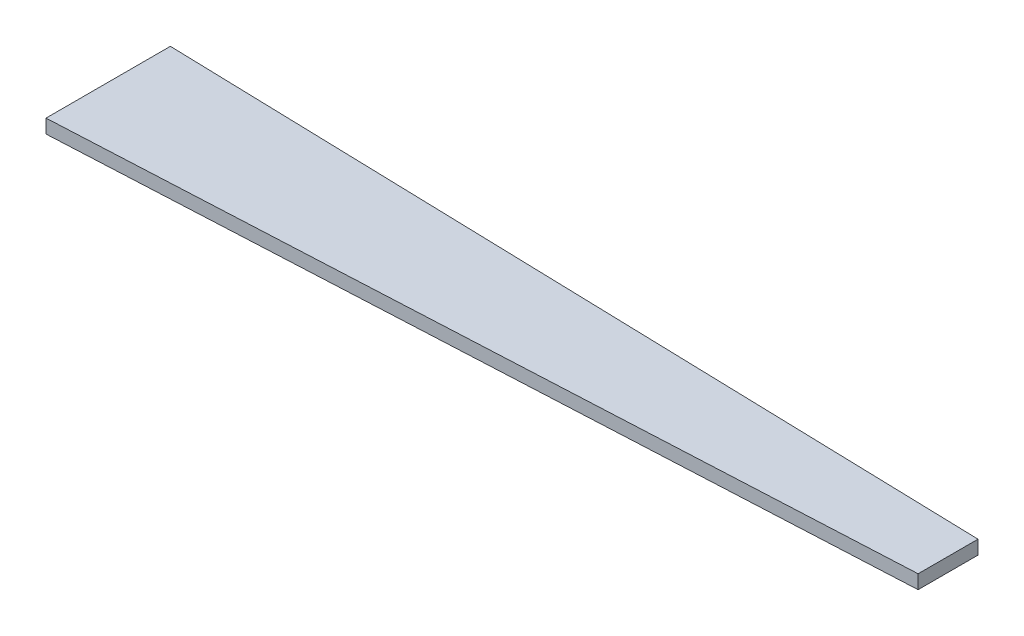
ISO-10303-21;
HEADER;
FILE_DESCRIPTION(('STEP AP214'),'2;1');
FILE_NAME('part.step','',(''),(''),'','','');
FILE_SCHEMA(('AUTOMOTIVE_DESIGN { 1 0 10303 214 1 1 1 1 }'));
ENDSEC;
DATA;
#1=APPLICATION_CONTEXT('core data for automotive mechanical design processes');
#2=APPLICATION_PROTOCOL_DEFINITION('international standard','automotive_design',2000,#1);
#3=PRODUCT_CONTEXT('',#1,'mechanical');
#4=PRODUCT('Part','Part','',(#3));
#5=PRODUCT_RELATED_PRODUCT_CATEGORY('part','',(#4));
#6=PRODUCT_DEFINITION_FORMATION('','',#4);
#7=PRODUCT_DEFINITION_CONTEXT('part definition',#1,'design');
#8=PRODUCT_DEFINITION('design','',#6,#7);
#9=PRODUCT_DEFINITION_SHAPE('','',#8);
#10=(LENGTH_UNIT() NAMED_UNIT(*) SI_UNIT(.MILLI.,.METRE.));
#11=(NAMED_UNIT(*) PLANE_ANGLE_UNIT() SI_UNIT($,.RADIAN.));
#12=(NAMED_UNIT(*) SI_UNIT($,.STERADIAN.) SOLID_ANGLE_UNIT());
#13=UNCERTAINTY_MEASURE_WITH_UNIT(LENGTH_MEASURE(1.E-05),#10,'distance_accuracy_value','');
#14=(GEOMETRIC_REPRESENTATION_CONTEXT(3) GLOBAL_UNCERTAINTY_ASSIGNED_CONTEXT((#13)) GLOBAL_UNIT_ASSIGNED_CONTEXT((#10,
#11,#12)) REPRESENTATION_CONTEXT('',''));
#15=CARTESIAN_POINT('',(0.,0.,0.));
#16=DIRECTION('',(0.,0.,1.));
#17=DIRECTION('',(1.,0.,0.));
#18=AXIS2_PLACEMENT_3D('',#15,#16,#17);
#19=CARTESIAN_POINT('',(0.,30.,0.));
#20=DIRECTION('',(0.0277175651333732,0.,-0.9996157944846));
#21=DIRECTION('',(-0.9996157944846,0.,-0.0277175651333732));
#22=AXIS2_PLACEMENT_3D('',#19,#20,#21);
#23=PLANE('',#22);
#24=DIRECTION('',(0.9996157944846,0.,0.0277175651333732));
#25=VECTOR('',#24,1.);
#26=CARTESIAN_POINT('',(0.,0.,0.));
#27=LINE('',#26,#25);
#28=CARTESIAN_POINT('',(0.,0.,0.));
#29=VERTEX_POINT('',#28);
#30=CARTESIAN_POINT('',(1803.21718317352,0.,50.));
#31=VERTEX_POINT('',#30);
#32=EDGE_CURVE('E98',#29,#31,#27,.T.);
#33=ORIENTED_EDGE('',*,*,#32,.F.);
#34=DIRECTION('',(0.,-1.,0.));
#35=VECTOR('',#34,1.);
#36=CARTESIAN_POINT('',(0.,30.,0.));
#37=LINE('',#36,#35);
#38=CARTESIAN_POINT('',(0.,30.,0.));
#39=VERTEX_POINT('',#38);
#40=EDGE_CURVE('E11',#39,#29,#37,.T.);
#41=ORIENTED_EDGE('',*,*,#40,.F.);
#42=DIRECTION('',(0.9996157944846,0.,0.0277175651333732));
#43=VECTOR('',#42,1.);
#44=CARTESIAN_POINT('',(0.,30.,0.));
#45=LINE('',#44,#43);
#46=CARTESIAN_POINT('',(1803.21718317352,30.,50.));
#47=VERTEX_POINT('',#46);
#48=EDGE_CURVE('E92',#39,#47,#45,.T.);
#49=ORIENTED_EDGE('',*,*,#48,.T.);
#50=DIRECTION('',(0.,-1.,0.));
#51=VECTOR('',#50,1.);
#52=CARTESIAN_POINT('',(1803.21718317352,30.,50.));
#53=LINE('',#52,#51);
#54=EDGE_CURVE('E36',#47,#31,#53,.T.);
#55=ORIENTED_EDGE('',*,*,#54,.T.);
#56=EDGE_LOOP('',(#33,#41,#49,#55));
#57=FACE_BOUND('',#56,.T.);
#58=ADVANCED_FACE('F33',(#57),#23,.T.);
#59=CARTESIAN_POINT('',(0.,30.,0.));
#60=DIRECTION('',(1.,0.,0.));
#61=DIRECTION('',(0.,0.,-1.));
#62=AXIS2_PLACEMENT_3D('',#59,#60,#61);
#63=PLANE('',#62);
#64=DIRECTION('',(0.,0.,1.));
#65=VECTOR('',#64,1.);
#66=CARTESIAN_POINT('',(0.,0.,0.));
#67=LINE('',#66,#65);
#68=CARTESIAN_POINT('',(0.,0.,270.));
#69=VERTEX_POINT('',#68);
#70=EDGE_CURVE('E94',#29,#69,#67,.T.);
#71=ORIENTED_EDGE('',*,*,#70,.T.);
#72=DIRECTION('',(0.,-1.,0.));
#73=VECTOR('',#72,1.);
#74=CARTESIAN_POINT('',(0.,30.,270.));
#75=LINE('',#74,#73);
#76=CARTESIAN_POINT('',(0.,30.,270.));
#77=VERTEX_POINT('',#76);
#78=EDGE_CURVE('E42',#77,#69,#75,.T.);
#79=ORIENTED_EDGE('',*,*,#78,.F.);
#80=DIRECTION('',(0.,0.,1.));
#81=VECTOR('',#80,1.);
#82=CARTESIAN_POINT('',(0.,30.,0.));
#83=LINE('',#82,#81);
#84=EDGE_CURVE('E89',#39,#77,#83,.T.);
#85=ORIENTED_EDGE('',*,*,#84,.F.);
#86=ORIENTED_EDGE('',*,*,#40,.T.);
#87=EDGE_LOOP('',(#71,#79,#85,#86));
#88=FACE_BOUND('',#87,.T.);
#89=ADVANCED_FACE('F105',(#88),#63,.F.);
#90=CARTESIAN_POINT('',(1803.21718317352,30.,180.));
#91=DIRECTION('',(0.0498487430762205,0.,0.998756778607145));
#92=DIRECTION('',(0.998756778607145,0.,-0.0498487430762205));
#93=AXIS2_PLACEMENT_3D('',#90,#91,#92);
#94=PLANE('',#93);
#95=DIRECTION('',(-0.998756778607145,0.,0.0498487430762205));
#96=VECTOR('',#95,1.);
#97=CARTESIAN_POINT('',(1803.21718317352,0.,180.));
#98=LINE('',#97,#96);
#99=CARTESIAN_POINT('',(1803.21718317352,0.,180.));
#100=VERTEX_POINT('',#99);
#101=EDGE_CURVE('E83',#100,#69,#98,.T.);
#102=ORIENTED_EDGE('',*,*,#101,.F.);
#103=DIRECTION('',(0.,-1.,0.));
#104=VECTOR('',#103,1.);
#105=CARTESIAN_POINT('',(1803.21718317352,30.,180.));
#106=LINE('',#105,#104);
#107=CARTESIAN_POINT('',(1803.21718317352,30.,180.));
#108=VERTEX_POINT('',#107);
#109=EDGE_CURVE('E78',#108,#100,#106,.T.);
#110=ORIENTED_EDGE('',*,*,#109,.F.);
#111=DIRECTION('',(-0.998756778607145,0.,0.0498487430762205));
#112=VECTOR('',#111,1.);
#113=CARTESIAN_POINT('',(1803.21718317352,30.,180.));
#114=LINE('',#113,#112);
#115=EDGE_CURVE('E81',#108,#77,#114,.T.);
#116=ORIENTED_EDGE('',*,*,#115,.T.);
#117=ORIENTED_EDGE('',*,*,#78,.T.);
#118=EDGE_LOOP('',(#102,#110,#116,#117));
#119=FACE_BOUND('',#118,.T.);
#120=ADVANCED_FACE('F80',(#119),#94,.T.);
#121=CARTESIAN_POINT('',(1803.21718317352,30.,50.));
#122=DIRECTION('',(1.,0.,0.));
#123=DIRECTION('',(0.,0.,-1.));
#124=AXIS2_PLACEMENT_3D('',#121,#122,#123);
#125=PLANE('',#124);
#126=DIRECTION('',(0.,0.,1.));
#127=VECTOR('',#126,1.);
#128=CARTESIAN_POINT('',(1803.21718317352,0.,50.));
#129=LINE('',#128,#127);
#130=EDGE_CURVE('E101',#31,#100,#129,.T.);
#131=ORIENTED_EDGE('',*,*,#130,.F.);
#132=ORIENTED_EDGE('',*,*,#54,.F.);
#133=DIRECTION('',(0.,0.,1.));
#134=VECTOR('',#133,1.);
#135=CARTESIAN_POINT('',(1803.21718317352,30.,50.));
#136=LINE('',#135,#134);
#137=EDGE_CURVE('E88',#47,#108,#136,.T.);
#138=ORIENTED_EDGE('',*,*,#137,.T.);
#139=ORIENTED_EDGE('',*,*,#109,.T.);
#140=EDGE_LOOP('',(#131,#132,#138,#139));
#141=FACE_BOUND('',#140,.T.);
#142=ADVANCED_FACE('F91',(#141),#125,.T.);
#143=CARTESIAN_POINT('',(0.,30.,0.));
#144=DIRECTION('',(0.,-1.,0.));
#145=DIRECTION('',(0.,0.,-1.));
#146=AXIS2_PLACEMENT_3D('',#143,#144,#145);
#147=PLANE('',#146);
#148=ORIENTED_EDGE('',*,*,#48,.F.);
#149=ORIENTED_EDGE('',*,*,#84,.T.);
#150=ORIENTED_EDGE('',*,*,#115,.F.);
#151=ORIENTED_EDGE('',*,*,#137,.F.);
#152=EDGE_LOOP('',(#148,#149,#150,#151));
#153=FACE_BOUND('',#152,.T.);
#154=ADVANCED_FACE('F87',(#153),#147,.F.);
#155=CARTESIAN_POINT('',(0.,0.,0.));
#156=DIRECTION('',(0.,-1.,0.));
#157=DIRECTION('',(0.,0.,-1.));
#158=AXIS2_PLACEMENT_3D('',#155,#156,#157);
#159=PLANE('',#158);
#160=ORIENTED_EDGE('',*,*,#32,.T.);
#161=ORIENTED_EDGE('',*,*,#130,.T.);
#162=ORIENTED_EDGE('',*,*,#101,.T.);
#163=ORIENTED_EDGE('',*,*,#70,.F.);
#164=EDGE_LOOP('',(#160,#161,#162,#163));
#165=FACE_BOUND('',#164,.T.);
#166=ADVANCED_FACE('F107',(#165),#159,.T.);
#167=CLOSED_SHELL('',(#58,#89,#120,#142,#154,#166));
#168=MANIFOLD_SOLID_BREP('B2',#167);
#169=ADVANCED_BREP_SHAPE_REPRESENTATION('',(#18,#168),#14);
#170=SHAPE_DEFINITION_REPRESENTATION(#9,#169);
ENDSEC;
END-ISO-10303-21;
